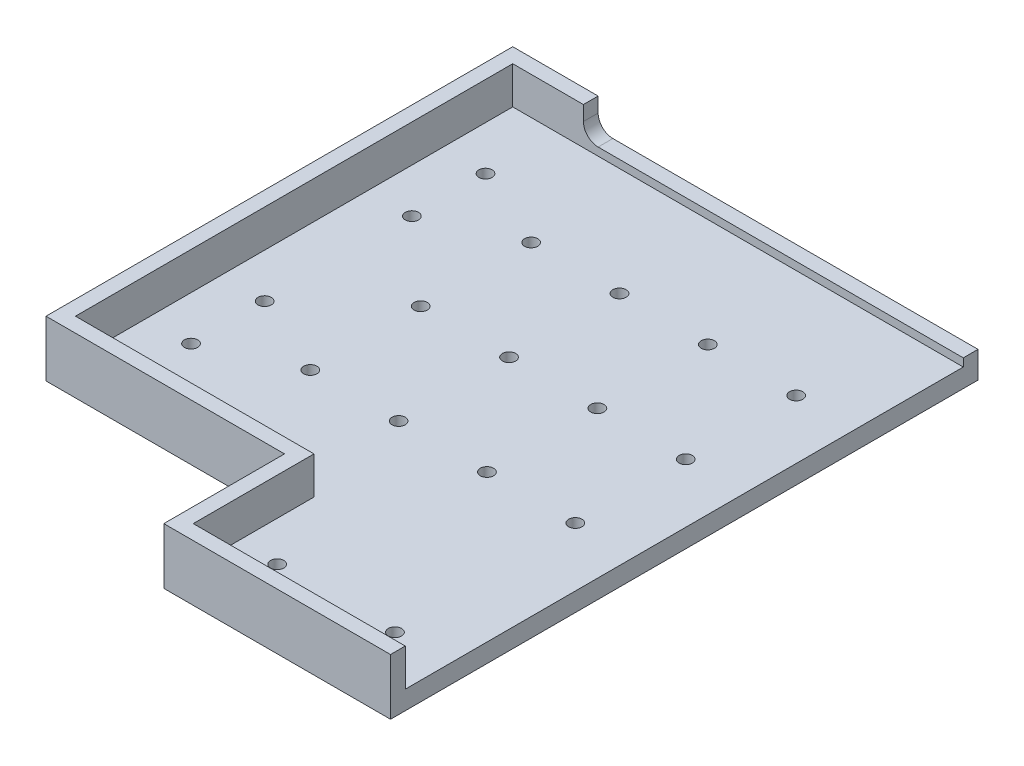
ISO-10303-21;
HEADER;
FILE_DESCRIPTION(('STEP AP214'),'2;1');
FILE_NAME('part.step','',(''),(''),'','','');
FILE_SCHEMA(('AUTOMOTIVE_DESIGN { 1 0 10303 214 1 1 1 1 }'));
ENDSEC;
DATA;
#1=APPLICATION_CONTEXT('core data for automotive mechanical design processes');
#2=APPLICATION_PROTOCOL_DEFINITION('international standard','automotive_design',2000,#1);
#3=PRODUCT_CONTEXT('',#1,'mechanical');
#4=PRODUCT('Part','Part','',(#3));
#5=PRODUCT_RELATED_PRODUCT_CATEGORY('part','',(#4));
#6=PRODUCT_DEFINITION_FORMATION('','',#4);
#7=PRODUCT_DEFINITION_CONTEXT('part definition',#1,'design');
#8=PRODUCT_DEFINITION('design','',#6,#7);
#9=PRODUCT_DEFINITION_SHAPE('','',#8);
#10=(LENGTH_UNIT() NAMED_UNIT(*) SI_UNIT(.MILLI.,.METRE.));
#11=(NAMED_UNIT(*) PLANE_ANGLE_UNIT() SI_UNIT($,.RADIAN.));
#12=(NAMED_UNIT(*) SI_UNIT($,.STERADIAN.) SOLID_ANGLE_UNIT());
#13=UNCERTAINTY_MEASURE_WITH_UNIT(LENGTH_MEASURE(1.E-05),#10,'distance_accuracy_value','');
#14=(GEOMETRIC_REPRESENTATION_CONTEXT(3) GLOBAL_UNCERTAINTY_ASSIGNED_CONTEXT((#13)) GLOBAL_UNIT_ASSIGNED_CONTEXT((#10,
#11,#12)) REPRESENTATION_CONTEXT('',''));
#15=CARTESIAN_POINT('',(0.,0.,0.));
#16=DIRECTION('',(0.,0.,1.));
#17=DIRECTION('',(1.,0.,0.));
#18=AXIS2_PLACEMENT_3D('',#15,#16,#17);
#19=CARTESIAN_POINT('',(48.,6.35,41.75));
#20=DIRECTION('',(0.,1.,0.));
#21=DIRECTION('',(0.,0.,1.));
#22=AXIS2_PLACEMENT_3D('',#19,#20,#21);
#23=CYLINDRICAL_SURFACE('',#22,2.25);
#24=CARTESIAN_POINT('',(48.,0.,41.75));
#25=DIRECTION('',(0.,1.,0.));
#26=DIRECTION('',(0.,0.,1.));
#27=AXIS2_PLACEMENT_3D('',#24,#25,#26);
#28=CIRCLE('',#27,2.25);
#29=CARTESIAN_POINT('',(48.,0.,44.));
#30=VERTEX_POINT('',#29);
#31=EDGE_CURVE('E51',#30,#30,#28,.T.);
#32=ORIENTED_EDGE('',*,*,#31,.F.);
#33=EDGE_LOOP('',(#32));
#34=FACE_BOUND('',#33,.T.);
#35=CARTESIAN_POINT('',(48.,6.35,41.75));
#36=DIRECTION('',(0.,1.,0.));
#37=DIRECTION('',(0.,0.,1.));
#38=AXIS2_PLACEMENT_3D('',#35,#36,#37);
#39=CIRCLE('',#38,2.25);
#40=CARTESIAN_POINT('',(48.,6.35,44.));
#41=VERTEX_POINT('',#40);
#42=EDGE_CURVE('E11',#41,#41,#39,.T.);
#43=ORIENTED_EDGE('',*,*,#42,.T.);
#44=EDGE_LOOP('',(#43));
#45=FACE_BOUND('',#44,.T.);
#46=ADVANCED_FACE('F43',(#34,#45),#23,.F.);
#47=CARTESIAN_POINT('',(78.,6.35,41.75));
#48=DIRECTION('',(0.,1.,0.));
#49=DIRECTION('',(0.,0.,1.));
#50=AXIS2_PLACEMENT_3D('',#47,#48,#49);
#51=CYLINDRICAL_SURFACE('',#50,2.25);
#52=CARTESIAN_POINT('',(78.,0.,41.75));
#53=DIRECTION('',(0.,1.,0.));
#54=DIRECTION('',(0.,0.,1.));
#55=AXIS2_PLACEMENT_3D('',#52,#53,#54);
#56=CIRCLE('',#55,2.25);
#57=CARTESIAN_POINT('',(78.,0.,44.));
#58=VERTEX_POINT('',#57);
#59=EDGE_CURVE('E343',#58,#58,#56,.T.);
#60=ORIENTED_EDGE('',*,*,#59,.F.);
#61=EDGE_LOOP('',(#60));
#62=FACE_BOUND('',#61,.T.);
#63=CARTESIAN_POINT('',(78.,6.35,41.75));
#64=DIRECTION('',(0.,1.,0.));
#65=DIRECTION('',(0.,0.,1.));
#66=AXIS2_PLACEMENT_3D('',#63,#64,#65);
#67=CIRCLE('',#66,2.25);
#68=CARTESIAN_POINT('',(78.,6.35,44.));
#69=VERTEX_POINT('',#68);
#70=EDGE_CURVE('E347',#69,#69,#67,.T.);
#71=ORIENTED_EDGE('',*,*,#70,.T.);
#72=EDGE_LOOP('',(#71));
#73=FACE_BOUND('',#72,.T.);
#74=ADVANCED_FACE('F359',(#62,#73),#51,.F.);
#75=CARTESIAN_POINT('',(108.,6.35,41.75));
#76=DIRECTION('',(0.,1.,0.));
#77=DIRECTION('',(0.,0.,1.));
#78=AXIS2_PLACEMENT_3D('',#75,#76,#77);
#79=CYLINDRICAL_SURFACE('',#78,2.25);
#80=CARTESIAN_POINT('',(108.,0.,41.75));
#81=DIRECTION('',(0.,1.,0.));
#82=DIRECTION('',(0.,0.,1.));
#83=AXIS2_PLACEMENT_3D('',#80,#81,#82);
#84=CIRCLE('',#83,2.25);
#85=CARTESIAN_POINT('',(108.,0.,44.));
#86=VERTEX_POINT('',#85);
#87=EDGE_CURVE('E335',#86,#86,#84,.T.);
#88=ORIENTED_EDGE('',*,*,#87,.F.);
#89=EDGE_LOOP('',(#88));
#90=FACE_BOUND('',#89,.T.);
#91=CARTESIAN_POINT('',(108.,6.35,41.75));
#92=DIRECTION('',(0.,1.,0.));
#93=DIRECTION('',(0.,0.,1.));
#94=AXIS2_PLACEMENT_3D('',#91,#92,#93);
#95=CIRCLE('',#94,2.25);
#96=CARTESIAN_POINT('',(108.,6.35,44.));
#97=VERTEX_POINT('',#96);
#98=EDGE_CURVE('E339',#97,#97,#95,.T.);
#99=ORIENTED_EDGE('',*,*,#98,.T.);
#100=EDGE_LOOP('',(#99));
#101=FACE_BOUND('',#100,.T.);
#102=ADVANCED_FACE('F424',(#90,#101),#79,.F.);
#103=CARTESIAN_POINT('',(138.,6.35,41.75));
#104=DIRECTION('',(0.,1.,0.));
#105=DIRECTION('',(0.,0.,1.));
#106=AXIS2_PLACEMENT_3D('',#103,#104,#105);
#107=CYLINDRICAL_SURFACE('',#106,2.25);
#108=CARTESIAN_POINT('',(138.,0.,41.75));
#109=DIRECTION('',(0.,1.,0.));
#110=DIRECTION('',(0.,0.,1.));
#111=AXIS2_PLACEMENT_3D('',#108,#109,#110);
#112=CIRCLE('',#111,2.25);
#113=CARTESIAN_POINT('',(138.,0.,44.));
#114=VERTEX_POINT('',#113);
#115=EDGE_CURVE('E327',#114,#114,#112,.T.);
#116=ORIENTED_EDGE('',*,*,#115,.F.);
#117=EDGE_LOOP('',(#116));
#118=FACE_BOUND('',#117,.T.);
#119=CARTESIAN_POINT('',(138.,6.35,41.75));
#120=DIRECTION('',(0.,1.,0.));
#121=DIRECTION('',(0.,0.,1.));
#122=AXIS2_PLACEMENT_3D('',#119,#120,#121);
#123=CIRCLE('',#122,2.25);
#124=CARTESIAN_POINT('',(138.,6.35,44.));
#125=VERTEX_POINT('',#124);
#126=EDGE_CURVE('E331',#125,#125,#123,.T.);
#127=ORIENTED_EDGE('',*,*,#126,.T.);
#128=EDGE_LOOP('',(#127));
#129=FACE_BOUND('',#128,.T.);
#130=ADVANCED_FACE('F420',(#118,#129),#107,.F.);
#131=CARTESIAN_POINT('',(48.0000000000001,6.35,79.25));
#132=DIRECTION('',(0.,1.,0.));
#133=DIRECTION('',(0.,0.,1.));
#134=AXIS2_PLACEMENT_3D('',#131,#132,#133);
#135=CYLINDRICAL_SURFACE('',#134,2.25);
#136=CARTESIAN_POINT('',(48.0000000000001,0.,79.25));
#137=DIRECTION('',(0.,1.,0.));
#138=DIRECTION('',(0.,0.,1.));
#139=AXIS2_PLACEMENT_3D('',#136,#137,#138);
#140=CIRCLE('',#139,2.25);
#141=CARTESIAN_POINT('',(48.0000000000001,0.,81.5));
#142=VERTEX_POINT('',#141);
#143=EDGE_CURVE('E319',#142,#142,#140,.T.);
#144=ORIENTED_EDGE('',*,*,#143,.F.);
#145=EDGE_LOOP('',(#144));
#146=FACE_BOUND('',#145,.T.);
#147=CARTESIAN_POINT('',(48.0000000000001,6.35,79.25));
#148=DIRECTION('',(0.,1.,0.));
#149=DIRECTION('',(0.,0.,1.));
#150=AXIS2_PLACEMENT_3D('',#147,#148,#149);
#151=CIRCLE('',#150,2.25);
#152=CARTESIAN_POINT('',(48.0000000000001,6.35,81.5));
#153=VERTEX_POINT('',#152);
#154=EDGE_CURVE('E323',#153,#153,#151,.T.);
#155=ORIENTED_EDGE('',*,*,#154,.T.);
#156=EDGE_LOOP('',(#155));
#157=FACE_BOUND('',#156,.T.);
#158=ADVANCED_FACE('F416',(#146,#157),#135,.F.);
#159=CARTESIAN_POINT('',(138.,6.35,79.25));
#160=DIRECTION('',(0.,1.,0.));
#161=DIRECTION('',(0.,0.,1.));
#162=AXIS2_PLACEMENT_3D('',#159,#160,#161);
#163=CYLINDRICAL_SURFACE('',#162,2.25);
#164=CARTESIAN_POINT('',(138.,0.,79.25));
#165=DIRECTION('',(0.,1.,0.));
#166=DIRECTION('',(0.,0.,1.));
#167=AXIS2_PLACEMENT_3D('',#164,#165,#166);
#168=CIRCLE('',#167,2.25);
#169=CARTESIAN_POINT('',(138.,0.,81.5));
#170=VERTEX_POINT('',#169);
#171=EDGE_CURVE('E311',#170,#170,#168,.T.);
#172=ORIENTED_EDGE('',*,*,#171,.F.);
#173=EDGE_LOOP('',(#172));
#174=FACE_BOUND('',#173,.T.);
#175=CARTESIAN_POINT('',(138.,6.35,79.25));
#176=DIRECTION('',(0.,1.,0.));
#177=DIRECTION('',(0.,0.,1.));
#178=AXIS2_PLACEMENT_3D('',#175,#176,#177);
#179=CIRCLE('',#178,2.25);
#180=CARTESIAN_POINT('',(138.,6.35,81.5));
#181=VERTEX_POINT('',#180);
#182=EDGE_CURVE('E315',#181,#181,#179,.T.);
#183=ORIENTED_EDGE('',*,*,#182,.T.);
#184=EDGE_LOOP('',(#183));
#185=FACE_BOUND('',#184,.T.);
#186=ADVANCED_FACE('F412',(#174,#185),#163,.F.);
#187=CARTESIAN_POINT('',(48.0000000000001,6.35,116.75));
#188=DIRECTION('',(0.,1.,0.));
#189=DIRECTION('',(0.,0.,1.));
#190=AXIS2_PLACEMENT_3D('',#187,#188,#189);
#191=CYLINDRICAL_SURFACE('',#190,2.25);
#192=CARTESIAN_POINT('',(48.0000000000001,0.,116.75));
#193=DIRECTION('',(0.,1.,0.));
#194=DIRECTION('',(0.,0.,1.));
#195=AXIS2_PLACEMENT_3D('',#192,#193,#194);
#196=CIRCLE('',#195,2.25);
#197=CARTESIAN_POINT('',(48.0000000000001,0.,119.));
#198=VERTEX_POINT('',#197);
#199=EDGE_CURVE('E303',#198,#198,#196,.T.);
#200=ORIENTED_EDGE('',*,*,#199,.F.);
#201=EDGE_LOOP('',(#200));
#202=FACE_BOUND('',#201,.T.);
#203=CARTESIAN_POINT('',(48.0000000000001,6.35,116.75));
#204=DIRECTION('',(0.,1.,0.));
#205=DIRECTION('',(0.,0.,1.));
#206=AXIS2_PLACEMENT_3D('',#203,#204,#205);
#207=CIRCLE('',#206,2.25);
#208=CARTESIAN_POINT('',(48.0000000000001,6.35,119.));
#209=VERTEX_POINT('',#208);
#210=EDGE_CURVE('E307',#209,#209,#207,.T.);
#211=ORIENTED_EDGE('',*,*,#210,.T.);
#212=EDGE_LOOP('',(#211));
#213=FACE_BOUND('',#212,.T.);
#214=ADVANCED_FACE('F408',(#202,#213),#191,.F.);
#215=CARTESIAN_POINT('',(78.0000000000001,6.35,116.75));
#216=DIRECTION('',(0.,1.,0.));
#217=DIRECTION('',(0.,0.,1.));
#218=AXIS2_PLACEMENT_3D('',#215,#216,#217);
#219=CYLINDRICAL_SURFACE('',#218,2.25);
#220=CARTESIAN_POINT('',(78.0000000000001,0.,116.75));
#221=DIRECTION('',(0.,1.,0.));
#222=DIRECTION('',(0.,0.,1.));
#223=AXIS2_PLACEMENT_3D('',#220,#221,#222);
#224=CIRCLE('',#223,2.25);
#225=CARTESIAN_POINT('',(78.0000000000001,0.,119.));
#226=VERTEX_POINT('',#225);
#227=EDGE_CURVE('E295',#226,#226,#224,.T.);
#228=ORIENTED_EDGE('',*,*,#227,.F.);
#229=EDGE_LOOP('',(#228));
#230=FACE_BOUND('',#229,.T.);
#231=CARTESIAN_POINT('',(78.0000000000001,6.35,116.75));
#232=DIRECTION('',(0.,1.,0.));
#233=DIRECTION('',(0.,0.,1.));
#234=AXIS2_PLACEMENT_3D('',#231,#232,#233);
#235=CIRCLE('',#234,2.25);
#236=CARTESIAN_POINT('',(78.0000000000001,6.35,119.));
#237=VERTEX_POINT('',#236);
#238=EDGE_CURVE('E299',#237,#237,#235,.T.);
#239=ORIENTED_EDGE('',*,*,#238,.T.);
#240=EDGE_LOOP('',(#239));
#241=FACE_BOUND('',#240,.T.);
#242=ADVANCED_FACE('F404',(#230,#241),#219,.F.);
#243=CARTESIAN_POINT('',(78.0000000000001,6.35,79.25));
#244=DIRECTION('',(0.,1.,0.));
#245=DIRECTION('',(0.,0.,1.));
#246=AXIS2_PLACEMENT_3D('',#243,#244,#245);
#247=CYLINDRICAL_SURFACE('',#246,2.25);
#248=CARTESIAN_POINT('',(78.0000000000001,0.,79.25));
#249=DIRECTION('',(0.,1.,0.));
#250=DIRECTION('',(0.,0.,1.));
#251=AXIS2_PLACEMENT_3D('',#248,#249,#250);
#252=CIRCLE('',#251,2.25);
#253=CARTESIAN_POINT('',(78.0000000000001,0.,81.5));
#254=VERTEX_POINT('',#253);
#255=EDGE_CURVE('E287',#254,#254,#252,.T.);
#256=ORIENTED_EDGE('',*,*,#255,.F.);
#257=EDGE_LOOP('',(#256));
#258=FACE_BOUND('',#257,.T.);
#259=CARTESIAN_POINT('',(78.0000000000001,6.35,79.25));
#260=DIRECTION('',(0.,1.,0.));
#261=DIRECTION('',(0.,0.,1.));
#262=AXIS2_PLACEMENT_3D('',#259,#260,#261);
#263=CIRCLE('',#262,2.25);
#264=CARTESIAN_POINT('',(78.0000000000001,6.35,81.5));
#265=VERTEX_POINT('',#264);
#266=EDGE_CURVE('E291',#265,#265,#263,.T.);
#267=ORIENTED_EDGE('',*,*,#266,.T.);
#268=EDGE_LOOP('',(#267));
#269=FACE_BOUND('',#268,.T.);
#270=ADVANCED_FACE('F384',(#258,#269),#247,.F.);
#271=CARTESIAN_POINT('',(0.,0.,0.));
#272=DIRECTION('',(0.,1.,0.));
#273=DIRECTION('',(0.,0.,1.));
#274=AXIS2_PLACEMENT_3D('',#271,#272,#273);
#275=PLANE('',#274);
#276=CARTESIAN_POINT('',(108.,0.,116.75));
#277=DIRECTION('',(0.,1.,0.));
#278=DIRECTION('',(0.,0.,1.));
#279=AXIS2_PLACEMENT_3D('',#276,#277,#278);
#280=CIRCLE('',#279,2.25);
#281=CARTESIAN_POINT('',(108.,0.,119.));
#282=VERTEX_POINT('',#281);
#283=EDGE_CURVE('E770',#282,#282,#280,.T.);
#284=ORIENTED_EDGE('',*,*,#283,.T.);
#285=EDGE_LOOP('',(#284));
#286=FACE_BOUND('',#285,.T.);
#287=CARTESIAN_POINT('',(108.,0.,79.25));
#288=DIRECTION('',(0.,1.,0.));
#289=DIRECTION('',(0.,0.,1.));
#290=AXIS2_PLACEMENT_3D('',#287,#288,#289);
#291=CIRCLE('',#290,2.25);
#292=CARTESIAN_POINT('',(108.,0.,81.5));
#293=VERTEX_POINT('',#292);
#294=EDGE_CURVE('E762',#293,#293,#291,.T.);
#295=ORIENTED_EDGE('',*,*,#294,.T.);
#296=EDGE_LOOP('',(#295));
#297=FACE_BOUND('',#296,.T.);
#298=CARTESIAN_POINT('',(138.,0.,116.75));
#299=DIRECTION('',(0.,1.,0.));
#300=DIRECTION('',(0.,0.,1.));
#301=AXIS2_PLACEMENT_3D('',#298,#299,#300);
#302=CIRCLE('',#301,2.25);
#303=CARTESIAN_POINT('',(138.,0.,119.));
#304=VERTEX_POINT('',#303);
#305=EDGE_CURVE('E174',#304,#304,#302,.T.);
#306=ORIENTED_EDGE('',*,*,#305,.T.);
#307=EDGE_LOOP('',(#306));
#308=FACE_BOUND('',#307,.T.);
#309=DIRECTION('',(1.,0.,0.));
#310=VECTOR('',#309,1.);
#311=CARTESIAN_POINT('',(0.,0.,199.5));
#312=LINE('',#311,#310);
#313=CARTESIAN_POINT('',(81.,0.,199.5));
#314=VERTEX_POINT('',#313);
#315=CARTESIAN_POINT('',(158.,0.,199.5));
#316=VERTEX_POINT('',#315);
#317=EDGE_CURVE('E259',#314,#316,#312,.T.);
#318=ORIENTED_EDGE('',*,*,#317,.F.);
#319=DIRECTION('',(0.,0.,-1.));
#320=VECTOR('',#319,1.);
#321=CARTESIAN_POINT('',(81.,0.,199.5));
#322=LINE('',#321,#320);
#323=CARTESIAN_POINT('',(81.,0.,158.5));
#324=VERTEX_POINT('',#323);
#325=EDGE_CURVE('E232',#314,#324,#322,.T.);
#326=ORIENTED_EDGE('',*,*,#325,.T.);
#327=DIRECTION('',(-1.,0.,0.));
#328=VECTOR('',#327,1.);
#329=CARTESIAN_POINT('',(81.,0.,158.5));
#330=LINE('',#329,#328);
#331=CARTESIAN_POINT('',(0.,0.,158.5));
#332=VERTEX_POINT('',#331);
#333=EDGE_CURVE('E236',#324,#332,#330,.T.);
#334=ORIENTED_EDGE('',*,*,#333,.T.);
#335=DIRECTION('',(0.,0.,1.));
#336=VECTOR('',#335,1.);
#337=CARTESIAN_POINT('',(0.,0.,0.));
#338=LINE('',#337,#336);
#339=CARTESIAN_POINT('',(0.,0.,0.));
#340=VERTEX_POINT('',#339);
#341=EDGE_CURVE('E244',#340,#332,#338,.T.);
#342=ORIENTED_EDGE('',*,*,#341,.F.);
#343=DIRECTION('',(-1.,0.,0.));
#344=VECTOR('',#343,1.);
#345=CARTESIAN_POINT('',(0.,0.,0.));
#346=LINE('',#345,#344);
#347=CARTESIAN_POINT('',(158.,0.,0.));
#348=VERTEX_POINT('',#347);
#349=EDGE_CURVE('E255',#348,#340,#346,.T.);
#350=ORIENTED_EDGE('',*,*,#349,.F.);
#351=DIRECTION('',(0.,0.,-1.));
#352=VECTOR('',#351,1.);
#353=CARTESIAN_POINT('',(158.,0.,0.));
#354=LINE('',#353,#352);
#355=EDGE_CURVE('E262',#316,#348,#354,.T.);
#356=ORIENTED_EDGE('',*,*,#355,.F.);
#357=EDGE_LOOP('',(#318,#326,#334,#342,#350,#356));
#358=FACE_BOUND('',#357,.T.);
#359=CARTESIAN_POINT('',(20.,0.,54.25));
#360=DIRECTION('',(0.,-1.,0.));
#361=DIRECTION('',(0.,0.,-1.));
#362=AXIS2_PLACEMENT_3D('',#359,#360,#361);
#363=CIRCLE('',#362,2.25);
#364=CARTESIAN_POINT('',(20.,0.,52.));
#365=VERTEX_POINT('',#364);
#366=EDGE_CURVE('E698',#365,#365,#363,.T.);
#367=ORIENTED_EDGE('',*,*,#366,.F.);
#368=EDGE_LOOP('',(#367));
#369=FACE_BOUND('',#368,.T.);
#370=CARTESIAN_POINT('',(20.,0.,29.25));
#371=DIRECTION('',(0.,-1.,0.));
#372=DIRECTION('',(0.,0.,-1.));
#373=AXIS2_PLACEMENT_3D('',#370,#371,#372);
#374=CIRCLE('',#373,2.25);
#375=CARTESIAN_POINT('',(20.,0.,27.));
#376=VERTEX_POINT('',#375);
#377=EDGE_CURVE('E706',#376,#376,#374,.T.);
#378=ORIENTED_EDGE('',*,*,#377,.F.);
#379=EDGE_LOOP('',(#378));
#380=FACE_BOUND('',#379,.T.);
#381=CARTESIAN_POINT('',(20.,0.,104.25));
#382=DIRECTION('',(0.,-1.,0.));
#383=DIRECTION('',(0.,0.,-1.));
#384=AXIS2_PLACEMENT_3D('',#381,#382,#383);
#385=CIRCLE('',#384,2.25);
#386=CARTESIAN_POINT('',(20.,0.,102.));
#387=VERTEX_POINT('',#386);
#388=EDGE_CURVE('E714',#387,#387,#385,.T.);
#389=ORIENTED_EDGE('',*,*,#388,.F.);
#390=EDGE_LOOP('',(#389));
#391=FACE_BOUND('',#390,.T.);
#392=CARTESIAN_POINT('',(20.,0.,129.25));
#393=DIRECTION('',(0.,-1.,0.));
#394=DIRECTION('',(0.,0.,-1.));
#395=AXIS2_PLACEMENT_3D('',#392,#393,#394);
#396=CIRCLE('',#395,2.25);
#397=CARTESIAN_POINT('',(20.,0.,127.));
#398=VERTEX_POINT('',#397);
#399=EDGE_CURVE('E722',#398,#398,#396,.T.);
#400=ORIENTED_EDGE('',*,*,#399,.F.);
#401=EDGE_LOOP('',(#400));
#402=FACE_BOUND('',#401,.T.);
#403=CARTESIAN_POINT('',(139.5,0.,179.5));
#404=DIRECTION('',(0.,-1.,0.));
#405=DIRECTION('',(0.,0.,-1.));
#406=AXIS2_PLACEMENT_3D('',#403,#404,#405);
#407=CIRCLE('',#406,2.25);
#408=CARTESIAN_POINT('',(139.5,0.,177.25));
#409=VERTEX_POINT('',#408);
#410=EDGE_CURVE('E730',#409,#409,#407,.T.);
#411=ORIENTED_EDGE('',*,*,#410,.F.);
#412=EDGE_LOOP('',(#411));
#413=FACE_BOUND('',#412,.T.);
#414=CARTESIAN_POINT('',(99.5,0.,179.5));
#415=DIRECTION('',(0.,-1.,0.));
#416=DIRECTION('',(0.,0.,-1.));
#417=AXIS2_PLACEMENT_3D('',#414,#415,#416);
#418=CIRCLE('',#417,2.25);
#419=CARTESIAN_POINT('',(99.5,0.,177.25));
#420=VERTEX_POINT('',#419);
#421=EDGE_CURVE('E738',#420,#420,#418,.T.);
#422=ORIENTED_EDGE('',*,*,#421,.F.);
#423=EDGE_LOOP('',(#422));
#424=FACE_BOUND('',#423,.T.);
#425=ORIENTED_EDGE('',*,*,#255,.T.);
#426=EDGE_LOOP('',(#425));
#427=FACE_BOUND('',#426,.T.);
#428=ORIENTED_EDGE('',*,*,#227,.T.);
#429=EDGE_LOOP('',(#428));
#430=FACE_BOUND('',#429,.T.);
#431=ORIENTED_EDGE('',*,*,#199,.T.);
#432=EDGE_LOOP('',(#431));
#433=FACE_BOUND('',#432,.T.);
#434=ORIENTED_EDGE('',*,*,#171,.T.);
#435=EDGE_LOOP('',(#434));
#436=FACE_BOUND('',#435,.T.);
#437=ORIENTED_EDGE('',*,*,#143,.T.);
#438=EDGE_LOOP('',(#437));
#439=FACE_BOUND('',#438,.T.);
#440=ORIENTED_EDGE('',*,*,#115,.T.);
#441=EDGE_LOOP('',(#440));
#442=FACE_BOUND('',#441,.T.);
#443=ORIENTED_EDGE('',*,*,#87,.T.);
#444=EDGE_LOOP('',(#443));
#445=FACE_BOUND('',#444,.T.);
#446=ORIENTED_EDGE('',*,*,#59,.T.);
#447=EDGE_LOOP('',(#446));
#448=FACE_BOUND('',#447,.T.);
#449=ORIENTED_EDGE('',*,*,#31,.T.);
#450=EDGE_LOOP('',(#449));
#451=FACE_BOUND('',#450,.T.);
#452=ADVANCED_FACE('F355',(#286,#297,#308,#358,#369,#380,#391,#402,#413,#424,#427,#430,#433,
#436,#439,#442,#445,#448,#451),#275,.F.);
#453=CARTESIAN_POINT('',(0.,6.35,0.));
#454=DIRECTION('',(1.,0.,0.));
#455=DIRECTION('',(0.,0.,-1.));
#456=AXIS2_PLACEMENT_3D('',#453,#454,#455);
#457=PLANE('',#456);
#458=ORIENTED_EDGE('',*,*,#341,.T.);
#459=DIRECTION('',(0.,1.,0.));
#460=VECTOR('',#459,1.);
#461=CARTESIAN_POINT('',(0.,0.,158.5));
#462=LINE('',#461,#460);
#463=CARTESIAN_POINT('',(0.,19.05,158.5));
#464=VERTEX_POINT('',#463);
#465=EDGE_CURVE('E245',#332,#464,#462,.T.);
#466=ORIENTED_EDGE('',*,*,#465,.T.);
#467=DIRECTION('',(0.,0.,1.));
#468=VECTOR('',#467,1.);
#469=CARTESIAN_POINT('',(0.,19.05,0.));
#470=LINE('',#469,#468);
#471=CARTESIAN_POINT('',(0.,19.05,0.));
#472=VERTEX_POINT('',#471);
#473=EDGE_CURVE('E648',#472,#464,#470,.T.);
#474=ORIENTED_EDGE('',*,*,#473,.F.);
#475=DIRECTION('',(0.,-1.,0.));
#476=VECTOR('',#475,1.);
#477=CARTESIAN_POINT('',(0.,6.35,0.));
#478=LINE('',#477,#476);
#479=EDGE_CURVE('E254',#472,#340,#478,.T.);
#480=ORIENTED_EDGE('',*,*,#479,.T.);
#481=EDGE_LOOP('',(#458,#466,#474,#480));
#482=FACE_BOUND('',#481,.T.);
#483=ADVANCED_FACE('F383',(#482),#457,.F.);
#484=CARTESIAN_POINT('',(0.,6.35,199.5));
#485=DIRECTION('',(0.,0.,-1.));
#486=DIRECTION('',(-1.,0.,0.));
#487=AXIS2_PLACEMENT_3D('',#484,#485,#486);
#488=PLANE('',#487);
#489=DIRECTION('',(0.,-1.,0.));
#490=VECTOR('',#489,1.);
#491=CARTESIAN_POINT('',(158.,6.35,199.5));
#492=LINE('',#491,#490);
#493=CARTESIAN_POINT('',(158.,19.05,199.5));
#494=VERTEX_POINT('',#493);
#495=EDGE_CURVE('E274',#494,#316,#492,.T.);
#496=ORIENTED_EDGE('',*,*,#495,.F.);
#497=DIRECTION('',(1.,0.,0.));
#498=VECTOR('',#497,1.);
#499=CARTESIAN_POINT('',(81.,19.05,199.5));
#500=LINE('',#499,#498);
#501=CARTESIAN_POINT('',(81.,19.05,199.5));
#502=VERTEX_POINT('',#501);
#503=EDGE_CURVE('E653',#502,#494,#500,.T.);
#504=ORIENTED_EDGE('',*,*,#503,.F.);
#505=DIRECTION('',(0.,1.,0.));
#506=VECTOR('',#505,1.);
#507=CARTESIAN_POINT('',(81.,0.,199.5));
#508=LINE('',#507,#506);
#509=EDGE_CURVE('E241',#314,#502,#508,.T.);
#510=ORIENTED_EDGE('',*,*,#509,.F.);
#511=ORIENTED_EDGE('',*,*,#317,.T.);
#512=EDGE_LOOP('',(#496,#504,#510,#511));
#513=FACE_BOUND('',#512,.T.);
#514=ADVANCED_FACE('F389',(#513),#488,.F.);
#515=CARTESIAN_POINT('',(158.,6.35,0.));
#516=DIRECTION('',(-1.,0.,0.));
#517=DIRECTION('',(0.,0.,1.));
#518=AXIS2_PLACEMENT_3D('',#515,#516,#517);
#519=PLANE('',#518);
#520=DIRECTION('',(0.,-1.,0.));
#521=VECTOR('',#520,1.);
#522=CARTESIAN_POINT('',(158.,6.35,0.));
#523=LINE('',#522,#521);
#524=CARTESIAN_POINT('',(158.,9.04999999999998,0.));
#525=VERTEX_POINT('',#524);
#526=EDGE_CURVE('E271',#525,#348,#523,.T.);
#527=ORIENTED_EDGE('',*,*,#526,.F.);
#528=DIRECTION('',(0.,0.,-1.));
#529=VECTOR('',#528,1.);
#530=CARTESIAN_POINT('',(158.,9.04999999999998,199.501));
#531=LINE('',#530,#529);
#532=CARTESIAN_POINT('',(158.,9.04999999999999,5.));
#533=VERTEX_POINT('',#532);
#534=EDGE_CURVE('E162',#533,#525,#531,.T.);
#535=ORIENTED_EDGE('',*,*,#534,.F.);
#536=DIRECTION('',(0.,-1.,0.));
#537=VECTOR('',#536,1.);
#538=CARTESIAN_POINT('',(158.,19.05,5.));
#539=LINE('',#538,#537);
#540=CARTESIAN_POINT('',(158.,6.35,5.00000000000001));
#541=VERTEX_POINT('',#540);
#542=EDGE_CURVE('E181',#533,#541,#539,.T.);
#543=ORIENTED_EDGE('',*,*,#542,.T.);
#544=DIRECTION('',(0.,0.,-1.));
#545=VECTOR('',#544,1.);
#546=CARTESIAN_POINT('',(158.,6.35,0.));
#547=LINE('',#546,#545);
#548=CARTESIAN_POINT('',(158.,6.35,194.5));
#549=VERTEX_POINT('',#548);
#550=EDGE_CURVE('E250',#549,#541,#547,.T.);
#551=ORIENTED_EDGE('',*,*,#550,.F.);
#552=DIRECTION('',(0.,-1.,0.));
#553=VECTOR('',#552,1.);
#554=CARTESIAN_POINT('',(158.,19.05,194.5));
#555=LINE('',#554,#553);
#556=CARTESIAN_POINT('',(158.,19.05,194.5));
#557=VERTEX_POINT('',#556);
#558=EDGE_CURVE('E228',#557,#549,#555,.T.);
#559=ORIENTED_EDGE('',*,*,#558,.F.);
#560=DIRECTION('',(0.,0.,-1.));
#561=VECTOR('',#560,1.);
#562=CARTESIAN_POINT('',(158.,19.05,194.5));
#563=LINE('',#562,#561);
#564=EDGE_CURVE('E657',#494,#557,#563,.T.);
#565=ORIENTED_EDGE('',*,*,#564,.F.);
#566=ORIENTED_EDGE('',*,*,#495,.T.);
#567=ORIENTED_EDGE('',*,*,#355,.T.);
#568=EDGE_LOOP('',(#527,#535,#543,#551,#559,#565,#566,#567));
#569=FACE_BOUND('',#568,.T.);
#570=ADVANCED_FACE('F377',(#569),#519,.F.);
#571=CARTESIAN_POINT('',(0.,6.35,0.));
#572=DIRECTION('',(0.,0.,1.));
#573=DIRECTION('',(1.,0.,0.));
#574=AXIS2_PLACEMENT_3D('',#571,#572,#573);
#575=PLANE('',#574);
#576=DIRECTION('',(0.,1.,0.));
#577=VECTOR('',#576,1.);
#578=CARTESIAN_POINT('',(29.,19.05,0.));
#579=LINE('',#578,#577);
#580=CARTESIAN_POINT('',(29.,14.05,0.));
#581=VERTEX_POINT('',#580);
#582=CARTESIAN_POINT('',(29.,19.05,0.));
#583=VERTEX_POINT('',#582);
#584=EDGE_CURVE('E157',#581,#583,#579,.T.);
#585=ORIENTED_EDGE('',*,*,#584,.F.);
#586=CARTESIAN_POINT('',(34.,14.05,0.));
#587=DIRECTION('',(0.,0.,1.));
#588=DIRECTION('',(1.,0.,0.));
#589=AXIS2_PLACEMENT_3D('',#586,#587,#588);
#590=CIRCLE('',#589,5.);
#591=CARTESIAN_POINT('',(34.,9.05,0.));
#592=VERTEX_POINT('',#591);
#593=EDGE_CURVE('E58',#581,#592,#590,.T.);
#594=ORIENTED_EDGE('',*,*,#593,.T.);
#595=DIRECTION('',(-1.,0.,0.));
#596=VECTOR('',#595,1.);
#597=CARTESIAN_POINT('',(158.,9.04999999999998,0.));
#598=LINE('',#597,#596);
#599=EDGE_CURVE('E744',#525,#592,#598,.T.);
#600=ORIENTED_EDGE('',*,*,#599,.F.);
#601=ORIENTED_EDGE('',*,*,#526,.T.);
#602=ORIENTED_EDGE('',*,*,#349,.T.);
#603=ORIENTED_EDGE('',*,*,#479,.F.);
#604=DIRECTION('',(-1.,0.,0.));
#605=VECTOR('',#604,1.);
#606=CARTESIAN_POINT('',(158.,19.05,0.));
#607=LINE('',#606,#605);
#608=EDGE_CURVE('E212',#583,#472,#607,.T.);
#609=ORIENTED_EDGE('',*,*,#608,.F.);
#610=EDGE_LOOP('',(#585,#594,#600,#601,#602,#603,#609));
#611=FACE_BOUND('',#610,.T.);
#612=ADVANCED_FACE('F365',(#611),#575,.F.);
#613=CARTESIAN_POINT('',(0.,6.35,0.));
#614=DIRECTION('',(0.,1.,0.));
#615=DIRECTION('',(0.,0.,1.));
#616=AXIS2_PLACEMENT_3D('',#613,#614,#615);
#617=PLANE('',#616);
#618=CARTESIAN_POINT('',(108.,6.35,116.75));
#619=DIRECTION('',(0.,1.,0.));
#620=DIRECTION('',(0.,0.,1.));
#621=AXIS2_PLACEMENT_3D('',#618,#619,#620);
#622=CIRCLE('',#621,2.25);
#623=CARTESIAN_POINT('',(108.,6.35,119.));
#624=VERTEX_POINT('',#623);
#625=EDGE_CURVE('E766',#624,#624,#622,.T.);
#626=ORIENTED_EDGE('',*,*,#625,.F.);
#627=EDGE_LOOP('',(#626));
#628=FACE_BOUND('',#627,.T.);
#629=CARTESIAN_POINT('',(108.,6.35,79.25));
#630=DIRECTION('',(0.,1.,0.));
#631=DIRECTION('',(0.,0.,1.));
#632=AXIS2_PLACEMENT_3D('',#629,#630,#631);
#633=CIRCLE('',#632,2.25);
#634=CARTESIAN_POINT('',(108.,6.35,81.5));
#635=VERTEX_POINT('',#634);
#636=EDGE_CURVE('E758',#635,#635,#633,.T.);
#637=ORIENTED_EDGE('',*,*,#636,.F.);
#638=EDGE_LOOP('',(#637));
#639=FACE_BOUND('',#638,.T.);
#640=CARTESIAN_POINT('',(138.,6.35,116.75));
#641=DIRECTION('',(0.,1.,0.));
#642=DIRECTION('',(0.,0.,1.));
#643=AXIS2_PLACEMENT_3D('',#640,#641,#642);
#644=CIRCLE('',#643,2.25);
#645=CARTESIAN_POINT('',(138.,6.35,119.));
#646=VERTEX_POINT('',#645);
#647=EDGE_CURVE('E754',#646,#646,#644,.T.);
#648=ORIENTED_EDGE('',*,*,#647,.F.);
#649=EDGE_LOOP('',(#648));
#650=FACE_BOUND('',#649,.T.);
#651=CARTESIAN_POINT('',(99.5,6.35,179.5));
#652=DIRECTION('',(0.,1.,0.));
#653=DIRECTION('',(0.,0.,1.));
#654=AXIS2_PLACEMENT_3D('',#651,#652,#653);
#655=CIRCLE('',#654,2.25);
#656=CARTESIAN_POINT('',(99.5,6.35,181.75));
#657=VERTEX_POINT('',#656);
#658=EDGE_CURVE('E734',#657,#657,#655,.T.);
#659=ORIENTED_EDGE('',*,*,#658,.F.);
#660=EDGE_LOOP('',(#659));
#661=FACE_BOUND('',#660,.T.);
#662=CARTESIAN_POINT('',(139.5,6.35,179.5));
#663=DIRECTION('',(0.,1.,0.));
#664=DIRECTION('',(0.,0.,1.));
#665=AXIS2_PLACEMENT_3D('',#662,#663,#664);
#666=CIRCLE('',#665,2.25);
#667=CARTESIAN_POINT('',(139.5,6.35,181.75));
#668=VERTEX_POINT('',#667);
#669=EDGE_CURVE('E726',#668,#668,#666,.T.);
#670=ORIENTED_EDGE('',*,*,#669,.F.);
#671=EDGE_LOOP('',(#670));
#672=FACE_BOUND('',#671,.T.);
#673=CARTESIAN_POINT('',(20.,6.35,129.25));
#674=DIRECTION('',(0.,1.,0.));
#675=DIRECTION('',(0.,0.,1.));
#676=AXIS2_PLACEMENT_3D('',#673,#674,#675);
#677=CIRCLE('',#676,2.25);
#678=CARTESIAN_POINT('',(20.,6.35,131.5));
#679=VERTEX_POINT('',#678);
#680=EDGE_CURVE('E718',#679,#679,#677,.T.);
#681=ORIENTED_EDGE('',*,*,#680,.F.);
#682=EDGE_LOOP('',(#681));
#683=FACE_BOUND('',#682,.T.);
#684=CARTESIAN_POINT('',(20.,6.35,104.25));
#685=DIRECTION('',(0.,1.,0.));
#686=DIRECTION('',(0.,0.,1.));
#687=AXIS2_PLACEMENT_3D('',#684,#685,#686);
#688=CIRCLE('',#687,2.25);
#689=CARTESIAN_POINT('',(20.,6.35,106.5));
#690=VERTEX_POINT('',#689);
#691=EDGE_CURVE('E710',#690,#690,#688,.T.);
#692=ORIENTED_EDGE('',*,*,#691,.F.);
#693=EDGE_LOOP('',(#692));
#694=FACE_BOUND('',#693,.T.);
#695=CARTESIAN_POINT('',(20.,6.35,29.25));
#696=DIRECTION('',(0.,1.,0.));
#697=DIRECTION('',(0.,0.,1.));
#698=AXIS2_PLACEMENT_3D('',#695,#696,#697);
#699=CIRCLE('',#698,2.25);
#700=CARTESIAN_POINT('',(20.,6.35,31.5));
#701=VERTEX_POINT('',#700);
#702=EDGE_CURVE('E702',#701,#701,#699,.T.);
#703=ORIENTED_EDGE('',*,*,#702,.F.);
#704=EDGE_LOOP('',(#703));
#705=FACE_BOUND('',#704,.T.);
#706=CARTESIAN_POINT('',(20.,6.35,54.25));
#707=DIRECTION('',(0.,1.,0.));
#708=DIRECTION('',(0.,0.,1.));
#709=AXIS2_PLACEMENT_3D('',#706,#707,#708);
#710=CIRCLE('',#709,2.25);
#711=CARTESIAN_POINT('',(20.,6.35,56.5));
#712=VERTEX_POINT('',#711);
#713=EDGE_CURVE('E197',#712,#712,#710,.T.);
#714=ORIENTED_EDGE('',*,*,#713,.F.);
#715=EDGE_LOOP('',(#714));
#716=FACE_BOUND('',#715,.T.);
#717=DIRECTION('',(1.,0.,0.));
#718=VECTOR('',#717,1.);
#719=CARTESIAN_POINT('',(158.,6.35,5.));
#720=LINE('',#719,#718);
#721=CARTESIAN_POINT('',(5.,6.35,5.00000000000002));
#722=VERTEX_POINT('',#721);
#723=EDGE_CURVE('E209',#722,#541,#720,.T.);
#724=ORIENTED_EDGE('',*,*,#723,.F.);
#725=DIRECTION('',(0.,0.,-1.));
#726=VECTOR('',#725,1.);
#727=CARTESIAN_POINT('',(5.,6.35,5.00000000000002));
#728=LINE('',#727,#726);
#729=CARTESIAN_POINT('',(5.00000000000002,6.35,153.5));
#730=VERTEX_POINT('',#729);
#731=EDGE_CURVE('E205',#730,#722,#728,.T.);
#732=ORIENTED_EDGE('',*,*,#731,.F.);
#733=DIRECTION('',(-1.,0.,0.));
#734=VECTOR('',#733,1.);
#735=CARTESIAN_POINT('',(5.00000000000002,6.35,153.5));
#736=LINE('',#735,#734);
#737=CARTESIAN_POINT('',(86.,6.35,153.5));
#738=VERTEX_POINT('',#737);
#739=EDGE_CURVE('E201',#738,#730,#736,.T.);
#740=ORIENTED_EDGE('',*,*,#739,.F.);
#741=DIRECTION('',(0.,0.,-1.));
#742=VECTOR('',#741,1.);
#743=CARTESIAN_POINT('',(86.,6.35,153.5));
#744=LINE('',#743,#742);
#745=CARTESIAN_POINT('',(86.,6.35,194.5));
#746=VERTEX_POINT('',#745);
#747=EDGE_CURVE('E196',#746,#738,#744,.T.);
#748=ORIENTED_EDGE('',*,*,#747,.F.);
#749=DIRECTION('',(-1.,0.,0.));
#750=VECTOR('',#749,1.);
#751=CARTESIAN_POINT('',(158.,6.35,194.5));
#752=LINE('',#751,#750);
#753=EDGE_CURVE('E192',#549,#746,#752,.T.);
#754=ORIENTED_EDGE('',*,*,#753,.F.);
#755=ORIENTED_EDGE('',*,*,#550,.T.);
#756=EDGE_LOOP('',(#724,#732,#740,#748,#754,#755));
#757=FACE_BOUND('',#756,.T.);
#758=ORIENTED_EDGE('',*,*,#266,.F.);
#759=EDGE_LOOP('',(#758));
#760=FACE_BOUND('',#759,.T.);
#761=ORIENTED_EDGE('',*,*,#238,.F.);
#762=EDGE_LOOP('',(#761));
#763=FACE_BOUND('',#762,.T.);
#764=ORIENTED_EDGE('',*,*,#210,.F.);
#765=EDGE_LOOP('',(#764));
#766=FACE_BOUND('',#765,.T.);
#767=ORIENTED_EDGE('',*,*,#182,.F.);
#768=EDGE_LOOP('',(#767));
#769=FACE_BOUND('',#768,.T.);
#770=ORIENTED_EDGE('',*,*,#154,.F.);
#771=EDGE_LOOP('',(#770));
#772=FACE_BOUND('',#771,.T.);
#773=ORIENTED_EDGE('',*,*,#126,.F.);
#774=EDGE_LOOP('',(#773));
#775=FACE_BOUND('',#774,.T.);
#776=ORIENTED_EDGE('',*,*,#98,.F.);
#777=EDGE_LOOP('',(#776));
#778=FACE_BOUND('',#777,.T.);
#779=ORIENTED_EDGE('',*,*,#70,.F.);
#780=EDGE_LOOP('',(#779));
#781=FACE_BOUND('',#780,.T.);
#782=ORIENTED_EDGE('',*,*,#42,.F.);
#783=EDGE_LOOP('',(#782));
#784=FACE_BOUND('',#783,.T.);
#785=ADVANCED_FACE('F362',(#628,#639,#650,#661,#672,#683,#694,#705,#716,#757,#760,#763,#766,
#769,#772,#775,#778,#781,#784),#617,.T.);
#786=CARTESIAN_POINT('',(81.,0.,199.5));
#787=DIRECTION('',(1.,0.,0.));
#788=DIRECTION('',(0.,0.,-1.));
#789=AXIS2_PLACEMENT_3D('',#786,#787,#788);
#790=PLANE('',#789);
#791=ORIENTED_EDGE('',*,*,#509,.T.);
#792=DIRECTION('',(0.,0.,1.));
#793=VECTOR('',#792,1.);
#794=CARTESIAN_POINT('',(81.,19.05,199.5));
#795=LINE('',#794,#793);
#796=CARTESIAN_POINT('',(81.,19.05,158.5));
#797=VERTEX_POINT('',#796);
#798=EDGE_CURVE('E645',#797,#502,#795,.T.);
#799=ORIENTED_EDGE('',*,*,#798,.F.);
#800=DIRECTION('',(0.,1.,0.));
#801=VECTOR('',#800,1.);
#802=CARTESIAN_POINT('',(81.,0.,158.5));
#803=LINE('',#802,#801);
#804=EDGE_CURVE('E240',#324,#797,#803,.T.);
#805=ORIENTED_EDGE('',*,*,#804,.F.);
#806=ORIENTED_EDGE('',*,*,#325,.F.);
#807=EDGE_LOOP('',(#791,#799,#805,#806));
#808=FACE_BOUND('',#807,.T.);
#809=ADVANCED_FACE('F364',(#808),#790,.F.);
#810=CARTESIAN_POINT('',(81.,0.,158.5));
#811=DIRECTION('',(0.,0.,-1.));
#812=DIRECTION('',(-1.,0.,0.));
#813=AXIS2_PLACEMENT_3D('',#810,#811,#812);
#814=PLANE('',#813);
#815=ORIENTED_EDGE('',*,*,#804,.T.);
#816=DIRECTION('',(1.,0.,0.));
#817=VECTOR('',#816,1.);
#818=CARTESIAN_POINT('',(81.,19.05,158.5));
#819=LINE('',#818,#817);
#820=EDGE_CURVE('E640',#464,#797,#819,.T.);
#821=ORIENTED_EDGE('',*,*,#820,.F.);
#822=ORIENTED_EDGE('',*,*,#465,.F.);
#823=ORIENTED_EDGE('',*,*,#333,.F.);
#824=EDGE_LOOP('',(#815,#821,#822,#823));
#825=FACE_BOUND('',#824,.T.);
#826=ADVANCED_FACE('F373',(#825),#814,.F.);
#827=CARTESIAN_POINT('',(158.,19.05,194.5));
#828=DIRECTION('',(0.,0.,1.));
#829=DIRECTION('',(1.,0.,0.));
#830=AXIS2_PLACEMENT_3D('',#827,#828,#829);
#831=PLANE('',#830);
#832=ORIENTED_EDGE('',*,*,#753,.T.);
#833=DIRECTION('',(0.,-1.,0.));
#834=VECTOR('',#833,1.);
#835=CARTESIAN_POINT('',(86.,19.05,194.5));
#836=LINE('',#835,#834);
#837=CARTESIAN_POINT('',(86.,19.05,194.5));
#838=VERTEX_POINT('',#837);
#839=EDGE_CURVE('E224',#838,#746,#836,.T.);
#840=ORIENTED_EDGE('',*,*,#839,.F.);
#841=DIRECTION('',(-1.,0.,0.));
#842=VECTOR('',#841,1.);
#843=CARTESIAN_POINT('',(158.,19.05,194.5));
#844=LINE('',#843,#842);
#845=EDGE_CURVE('E663',#557,#838,#844,.T.);
#846=ORIENTED_EDGE('',*,*,#845,.F.);
#847=ORIENTED_EDGE('',*,*,#558,.T.);
#848=EDGE_LOOP('',(#832,#840,#846,#847));
#849=FACE_BOUND('',#848,.T.);
#850=ADVANCED_FACE('F629',(#849),#831,.F.);
#851=CARTESIAN_POINT('',(86.,19.05,153.5));
#852=DIRECTION('',(-1.,0.,0.));
#853=DIRECTION('',(0.,0.,1.));
#854=AXIS2_PLACEMENT_3D('',#851,#852,#853);
#855=PLANE('',#854);
#856=ORIENTED_EDGE('',*,*,#747,.T.);
#857=DIRECTION('',(0.,-1.,0.));
#858=VECTOR('',#857,1.);
#859=CARTESIAN_POINT('',(86.,19.05,153.5));
#860=LINE('',#859,#858);
#861=CARTESIAN_POINT('',(86.,19.05,153.5));
#862=VERTEX_POINT('',#861);
#863=EDGE_CURVE('E220',#862,#738,#860,.T.);
#864=ORIENTED_EDGE('',*,*,#863,.F.);
#865=DIRECTION('',(0.,0.,-1.));
#866=VECTOR('',#865,1.);
#867=CARTESIAN_POINT('',(86.,19.05,153.5));
#868=LINE('',#867,#866);
#869=EDGE_CURVE('E666',#838,#862,#868,.T.);
#870=ORIENTED_EDGE('',*,*,#869,.F.);
#871=ORIENTED_EDGE('',*,*,#839,.T.);
#872=EDGE_LOOP('',(#856,#864,#870,#871));
#873=FACE_BOUND('',#872,.T.);
#874=ADVANCED_FACE('F625',(#873),#855,.F.);
#875=CARTESIAN_POINT('',(5.00000000000002,19.05,153.5));
#876=DIRECTION('',(0.,0.,1.));
#877=DIRECTION('',(1.,0.,0.));
#878=AXIS2_PLACEMENT_3D('',#875,#876,#877);
#879=PLANE('',#878);
#880=ORIENTED_EDGE('',*,*,#739,.T.);
#881=DIRECTION('',(0.,-1.,0.));
#882=VECTOR('',#881,1.);
#883=CARTESIAN_POINT('',(5.00000000000002,19.05,153.5));
#884=LINE('',#883,#882);
#885=CARTESIAN_POINT('',(5.00000000000002,19.05,153.5));
#886=VERTEX_POINT('',#885);
#887=EDGE_CURVE('E216',#886,#730,#884,.T.);
#888=ORIENTED_EDGE('',*,*,#887,.F.);
#889=DIRECTION('',(-1.,0.,0.));
#890=VECTOR('',#889,1.);
#891=CARTESIAN_POINT('',(5.00000000000002,19.05,153.5));
#892=LINE('',#891,#890);
#893=EDGE_CURVE('E188',#862,#886,#892,.T.);
#894=ORIENTED_EDGE('',*,*,#893,.F.);
#895=ORIENTED_EDGE('',*,*,#863,.T.);
#896=EDGE_LOOP('',(#880,#888,#894,#895));
#897=FACE_BOUND('',#896,.T.);
#898=ADVANCED_FACE('F621',(#897),#879,.F.);
#899=CARTESIAN_POINT('',(5.,19.05,5.00000000000002));
#900=DIRECTION('',(-1.,0.,0.));
#901=DIRECTION('',(0.,0.,1.));
#902=AXIS2_PLACEMENT_3D('',#899,#900,#901);
#903=PLANE('',#902);
#904=ORIENTED_EDGE('',*,*,#731,.T.);
#905=DIRECTION('',(0.,-1.,0.));
#906=VECTOR('',#905,1.);
#907=CARTESIAN_POINT('',(5.,19.05,5.00000000000002));
#908=LINE('',#907,#906);
#909=CARTESIAN_POINT('',(5.,19.05,5.00000000000002));
#910=VERTEX_POINT('',#909);
#911=EDGE_CURVE('E186',#910,#722,#908,.T.);
#912=ORIENTED_EDGE('',*,*,#911,.F.);
#913=DIRECTION('',(0.,0.,-1.));
#914=VECTOR('',#913,1.);
#915=CARTESIAN_POINT('',(5.,19.05,5.00000000000002));
#916=LINE('',#915,#914);
#917=EDGE_CURVE('E178',#886,#910,#916,.T.);
#918=ORIENTED_EDGE('',*,*,#917,.F.);
#919=ORIENTED_EDGE('',*,*,#887,.T.);
#920=EDGE_LOOP('',(#904,#912,#918,#919));
#921=FACE_BOUND('',#920,.T.);
#922=ADVANCED_FACE('F619',(#921),#903,.F.);
#923=CARTESIAN_POINT('',(158.,19.05,5.));
#924=DIRECTION('',(0.,0.,-1.));
#925=DIRECTION('',(-1.,0.,0.));
#926=AXIS2_PLACEMENT_3D('',#923,#924,#925);
#927=PLANE('',#926);
#928=ORIENTED_EDGE('',*,*,#542,.F.);
#929=DIRECTION('',(1.,0.,0.));
#930=VECTOR('',#929,1.);
#931=CARTESIAN_POINT('',(158.,9.04999999999998,5.));
#932=LINE('',#931,#930);
#933=CARTESIAN_POINT('',(34.,9.05,5.00000000000002));
#934=VERTEX_POINT('',#933);
#935=EDGE_CURVE('E173',#934,#533,#932,.T.);
#936=ORIENTED_EDGE('',*,*,#935,.F.);
#937=CARTESIAN_POINT('',(34.,14.05,5.00000000000003));
#938=DIRECTION('',(0.,0.,-1.));
#939=DIRECTION('',(-1.,0.,0.));
#940=AXIS2_PLACEMENT_3D('',#937,#938,#939);
#941=CIRCLE('',#940,5.);
#942=CARTESIAN_POINT('',(29.,14.05,5.00000000000003));
#943=VERTEX_POINT('',#942);
#944=EDGE_CURVE('E171',#934,#943,#941,.T.);
#945=ORIENTED_EDGE('',*,*,#944,.T.);
#946=DIRECTION('',(0.,-1.,0.));
#947=VECTOR('',#946,1.);
#948=CARTESIAN_POINT('',(29.,19.05,5.00000000000003));
#949=LINE('',#948,#947);
#950=CARTESIAN_POINT('',(29.,19.05,5.));
#951=VERTEX_POINT('',#950);
#952=EDGE_CURVE('E155',#951,#943,#949,.T.);
#953=ORIENTED_EDGE('',*,*,#952,.F.);
#954=DIRECTION('',(1.,0.,0.));
#955=VECTOR('',#954,1.);
#956=CARTESIAN_POINT('',(158.,19.05,5.));
#957=LINE('',#956,#955);
#958=EDGE_CURVE('E169',#910,#951,#957,.T.);
#959=ORIENTED_EDGE('',*,*,#958,.F.);
#960=ORIENTED_EDGE('',*,*,#911,.T.);
#961=ORIENTED_EDGE('',*,*,#723,.T.);
#962=EDGE_LOOP('',(#928,#936,#945,#953,#959,#960,#961));
#963=FACE_BOUND('',#962,.T.);
#964=ADVANCED_FACE('F167',(#963),#927,.F.);
#965=CARTESIAN_POINT('',(0.,19.05,0.));
#966=DIRECTION('',(0.,1.,0.));
#967=DIRECTION('',(0.,0.,1.));
#968=AXIS2_PLACEMENT_3D('',#965,#966,#967);
#969=PLANE('',#968);
#970=DIRECTION('',(0.,0.,-1.));
#971=VECTOR('',#970,1.);
#972=CARTESIAN_POINT('',(29.,19.05,199.501));
#973=LINE('',#972,#971);
#974=EDGE_CURVE('E151',#951,#583,#973,.T.);
#975=ORIENTED_EDGE('',*,*,#974,.T.);
#976=ORIENTED_EDGE('',*,*,#608,.T.);
#977=ORIENTED_EDGE('',*,*,#473,.T.);
#978=ORIENTED_EDGE('',*,*,#820,.T.);
#979=ORIENTED_EDGE('',*,*,#798,.T.);
#980=ORIENTED_EDGE('',*,*,#503,.T.);
#981=ORIENTED_EDGE('',*,*,#564,.T.);
#982=ORIENTED_EDGE('',*,*,#845,.T.);
#983=ORIENTED_EDGE('',*,*,#869,.T.);
#984=ORIENTED_EDGE('',*,*,#893,.T.);
#985=ORIENTED_EDGE('',*,*,#917,.T.);
#986=ORIENTED_EDGE('',*,*,#958,.T.);
#987=EDGE_LOOP('',(#975,#976,#977,#978,#979,#980,#981,#982,#983,#984,#985,#986));
#988=FACE_BOUND('',#987,.T.);
#989=ADVANCED_FACE('F176',(#988),#969,.T.);
#990=CARTESIAN_POINT('',(20.,0.,54.25));
#991=DIRECTION('',(0.,-1.,0.));
#992=DIRECTION('',(0.,0.,-1.));
#993=AXIS2_PLACEMENT_3D('',#990,#991,#992);
#994=CYLINDRICAL_SURFACE('',#993,2.25);
#995=ORIENTED_EDGE('',*,*,#366,.T.);
#996=EDGE_LOOP('',(#995));
#997=FACE_BOUND('',#996,.T.);
#998=ORIENTED_EDGE('',*,*,#713,.T.);
#999=EDGE_LOOP('',(#998));
#1000=FACE_BOUND('',#999,.T.);
#1001=ADVANCED_FACE('F493',(#997,#1000),#994,.F.);
#1002=CARTESIAN_POINT('',(20.,0.,29.25));
#1003=DIRECTION('',(0.,-1.,0.));
#1004=DIRECTION('',(0.,0.,-1.));
#1005=AXIS2_PLACEMENT_3D('',#1002,#1003,#1004);
#1006=CYLINDRICAL_SURFACE('',#1005,2.25);
#1007=ORIENTED_EDGE('',*,*,#377,.T.);
#1008=EDGE_LOOP('',(#1007));
#1009=FACE_BOUND('',#1008,.T.);
#1010=ORIENTED_EDGE('',*,*,#702,.T.);
#1011=EDGE_LOOP('',(#1010));
#1012=FACE_BOUND('',#1011,.T.);
#1013=ADVANCED_FACE('F498',(#1009,#1012),#1006,.F.);
#1014=CARTESIAN_POINT('',(20.,0.,104.25));
#1015=DIRECTION('',(0.,-1.,0.));
#1016=DIRECTION('',(0.,0.,-1.));
#1017=AXIS2_PLACEMENT_3D('',#1014,#1015,#1016);
#1018=CYLINDRICAL_SURFACE('',#1017,2.25);
#1019=ORIENTED_EDGE('',*,*,#388,.T.);
#1020=EDGE_LOOP('',(#1019));
#1021=FACE_BOUND('',#1020,.T.);
#1022=ORIENTED_EDGE('',*,*,#691,.T.);
#1023=EDGE_LOOP('',(#1022));
#1024=FACE_BOUND('',#1023,.T.);
#1025=ADVANCED_FACE('F509',(#1021,#1024),#1018,.F.);
#1026=CARTESIAN_POINT('',(20.,0.,129.25));
#1027=DIRECTION('',(0.,-1.,0.));
#1028=DIRECTION('',(0.,0.,-1.));
#1029=AXIS2_PLACEMENT_3D('',#1026,#1027,#1028);
#1030=CYLINDRICAL_SURFACE('',#1029,2.25);
#1031=ORIENTED_EDGE('',*,*,#399,.T.);
#1032=EDGE_LOOP('',(#1031));
#1033=FACE_BOUND('',#1032,.T.);
#1034=ORIENTED_EDGE('',*,*,#680,.T.);
#1035=EDGE_LOOP('',(#1034));
#1036=FACE_BOUND('',#1035,.T.);
#1037=ADVANCED_FACE('F519',(#1033,#1036),#1030,.F.);
#1038=CARTESIAN_POINT('',(139.5,0.,179.5));
#1039=DIRECTION('',(0.,-1.,0.));
#1040=DIRECTION('',(0.,0.,-1.));
#1041=AXIS2_PLACEMENT_3D('',#1038,#1039,#1040);
#1042=CYLINDRICAL_SURFACE('',#1041,2.25);
#1043=ORIENTED_EDGE('',*,*,#410,.T.);
#1044=EDGE_LOOP('',(#1043));
#1045=FACE_BOUND('',#1044,.T.);
#1046=ORIENTED_EDGE('',*,*,#669,.T.);
#1047=EDGE_LOOP('',(#1046));
#1048=FACE_BOUND('',#1047,.T.);
#1049=ADVANCED_FACE('F529',(#1045,#1048),#1042,.F.);
#1050=CARTESIAN_POINT('',(99.5,0.,179.5));
#1051=DIRECTION('',(0.,-1.,0.));
#1052=DIRECTION('',(0.,0.,-1.));
#1053=AXIS2_PLACEMENT_3D('',#1050,#1051,#1052);
#1054=CYLINDRICAL_SURFACE('',#1053,2.25);
#1055=ORIENTED_EDGE('',*,*,#421,.T.);
#1056=EDGE_LOOP('',(#1055));
#1057=FACE_BOUND('',#1056,.T.);
#1058=ORIENTED_EDGE('',*,*,#658,.T.);
#1059=EDGE_LOOP('',(#1058));
#1060=FACE_BOUND('',#1059,.T.);
#1061=ADVANCED_FACE('F539',(#1057,#1060),#1054,.F.);
#1062=CARTESIAN_POINT('',(158.,9.04999999999998,199.501));
#1063=DIRECTION('',(0.,-1.,0.));
#1064=DIRECTION('',(1.,0.,0.));
#1065=AXIS2_PLACEMENT_3D('',#1062,#1063,#1064);
#1066=PLANE('',#1065);
#1067=ORIENTED_EDGE('',*,*,#599,.T.);
#1068=DIRECTION('',(0.,0.,-1.));
#1069=VECTOR('',#1068,1.);
#1070=CARTESIAN_POINT('',(34.,9.05,5.));
#1071=LINE('',#1070,#1069);
#1072=EDGE_CURVE('E65',#592,#934,#1071,.F.);
#1073=ORIENTED_EDGE('',*,*,#1072,.T.);
#1074=ORIENTED_EDGE('',*,*,#935,.T.);
#1075=ORIENTED_EDGE('',*,*,#534,.T.);
#1076=EDGE_LOOP('',(#1067,#1073,#1074,#1075));
#1077=FACE_BOUND('',#1076,.T.);
#1078=ADVANCED_FACE('F549',(#1077),#1066,.F.);
#1079=CARTESIAN_POINT('',(29.,19.05,199.501));
#1080=DIRECTION('',(-1.,0.,0.));
#1081=DIRECTION('',(0.,0.,1.));
#1082=AXIS2_PLACEMENT_3D('',#1079,#1080,#1081);
#1083=PLANE('',#1082);
#1084=ORIENTED_EDGE('',*,*,#952,.T.);
#1085=DIRECTION('',(0.,0.,-1.));
#1086=VECTOR('',#1085,1.);
#1087=CARTESIAN_POINT('',(29.,14.05,0.));
#1088=LINE('',#1087,#1086);
#1089=EDGE_CURVE('E278',#943,#581,#1088,.T.);
#1090=ORIENTED_EDGE('',*,*,#1089,.T.);
#1091=ORIENTED_EDGE('',*,*,#584,.T.);
#1092=ORIENTED_EDGE('',*,*,#974,.F.);
#1093=EDGE_LOOP('',(#1084,#1090,#1091,#1092));
#1094=FACE_BOUND('',#1093,.T.);
#1095=ADVANCED_FACE('F153',(#1094),#1083,.F.);
#1096=CARTESIAN_POINT('',(34.,14.05,199.501));
#1097=DIRECTION('',(0.,0.,1.));
#1098=DIRECTION('',(1.,0.,0.));
#1099=AXIS2_PLACEMENT_3D('',#1096,#1097,#1098);
#1100=CYLINDRICAL_SURFACE('',#1099,5.);
#1101=ORIENTED_EDGE('',*,*,#944,.F.);
#1102=ORIENTED_EDGE('',*,*,#1072,.F.);
#1103=ORIENTED_EDGE('',*,*,#593,.F.);
#1104=ORIENTED_EDGE('',*,*,#1089,.F.);
#1105=EDGE_LOOP('',(#1101,#1102,#1103,#1104));
#1106=FACE_BOUND('',#1105,.T.);
#1107=ADVANCED_FACE('F397',(#1106),#1100,.F.);
#1108=CARTESIAN_POINT('',(138.,6.35,116.75));
#1109=DIRECTION('',(0.,1.,0.));
#1110=DIRECTION('',(0.,0.,1.));
#1111=AXIS2_PLACEMENT_3D('',#1108,#1109,#1110);
#1112=CYLINDRICAL_SURFACE('',#1111,2.25);
#1113=ORIENTED_EDGE('',*,*,#305,.F.);
#1114=EDGE_LOOP('',(#1113));
#1115=FACE_BOUND('',#1114,.T.);
#1116=ORIENTED_EDGE('',*,*,#647,.T.);
#1117=EDGE_LOOP('',(#1116));
#1118=FACE_BOUND('',#1117,.T.);
#1119=ADVANCED_FACE('F400',(#1115,#1118),#1112,.F.);
#1120=CARTESIAN_POINT('',(108.,6.35,79.25));
#1121=DIRECTION('',(0.,1.,0.));
#1122=DIRECTION('',(0.,0.,1.));
#1123=AXIS2_PLACEMENT_3D('',#1120,#1121,#1122);
#1124=CYLINDRICAL_SURFACE('',#1123,2.25);
#1125=ORIENTED_EDGE('',*,*,#294,.F.);
#1126=EDGE_LOOP('',(#1125));
#1127=FACE_BOUND('',#1126,.T.);
#1128=ORIENTED_EDGE('',*,*,#636,.T.);
#1129=EDGE_LOOP('',(#1128));
#1130=FACE_BOUND('',#1129,.T.);
#1131=ADVANCED_FACE('F580',(#1127,#1130),#1124,.F.);
#1132=CARTESIAN_POINT('',(108.,6.35,116.75));
#1133=DIRECTION('',(0.,1.,0.));
#1134=DIRECTION('',(0.,0.,1.));
#1135=AXIS2_PLACEMENT_3D('',#1132,#1133,#1134);
#1136=CYLINDRICAL_SURFACE('',#1135,2.25);
#1137=ORIENTED_EDGE('',*,*,#283,.F.);
#1138=EDGE_LOOP('',(#1137));
#1139=FACE_BOUND('',#1138,.T.);
#1140=ORIENTED_EDGE('',*,*,#625,.T.);
#1141=EDGE_LOOP('',(#1140));
#1142=FACE_BOUND('',#1141,.T.);
#1143=ADVANCED_FACE('F598',(#1139,#1142),#1136,.F.);
#1144=CLOSED_SHELL('',(#46,#74,#102,#130,#158,#186,#214,#242,#270,#452,#483,#514,#570,#612,#785,
#809,#826,#850,#874,#898,#922,#964,#989,#1001,#1013,#1025,#1037,#1049,#1061,#1078,#1095,#1107,
#1119,#1131,#1143));
#1145=MANIFOLD_SOLID_BREP('B2',#1144);
#1146=ADVANCED_BREP_SHAPE_REPRESENTATION('',(#18,#1145),#14);
#1147=SHAPE_DEFINITION_REPRESENTATION(#9,#1146);
ENDSEC;
END-ISO-10303-21;
